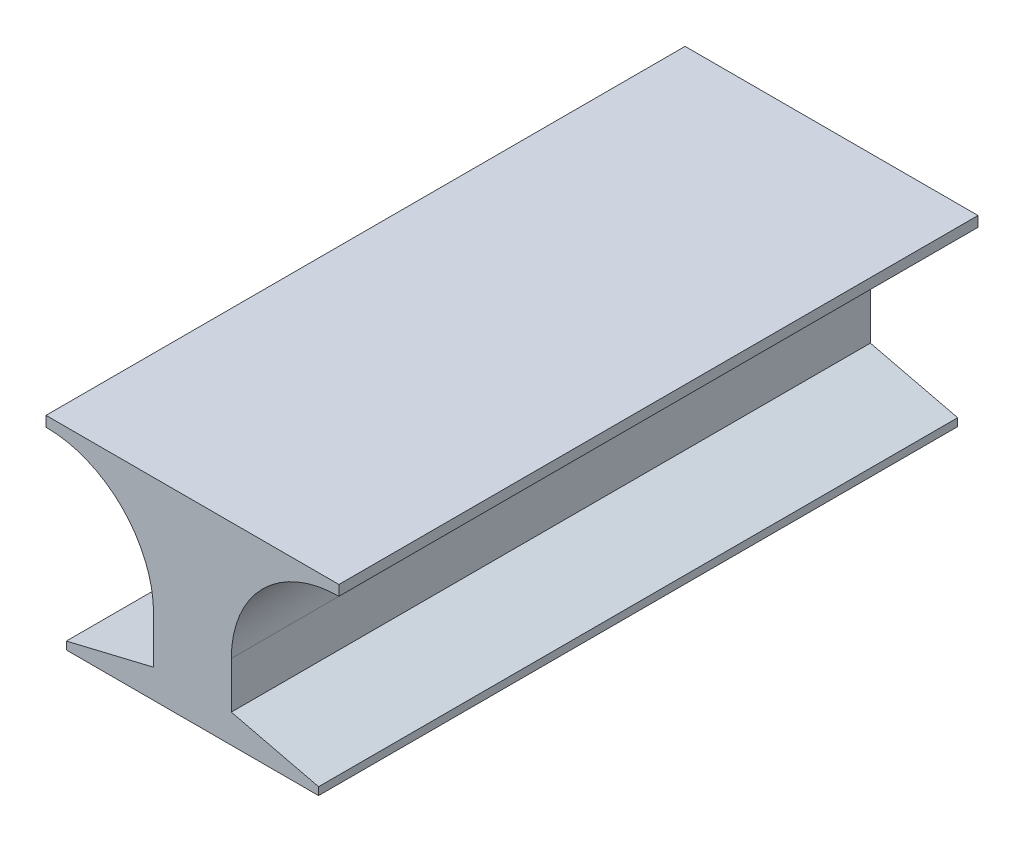
ISO-10303-21;
HEADER;
FILE_DESCRIPTION(('STEP AP214'),'2;1');
FILE_NAME('part.step','',(''),(''),'','','');
FILE_SCHEMA(('AUTOMOTIVE_DESIGN { 1 0 10303 214 1 1 1 1 }'));
ENDSEC;
DATA;
#1=APPLICATION_CONTEXT('core data for automotive mechanical design processes');
#2=APPLICATION_PROTOCOL_DEFINITION('international standard','automotive_design',2000,#1);
#3=PRODUCT_CONTEXT('',#1,'mechanical');
#4=PRODUCT('Part','Part','',(#3));
#5=PRODUCT_RELATED_PRODUCT_CATEGORY('part','',(#4));
#6=PRODUCT_DEFINITION_FORMATION('','',#4);
#7=PRODUCT_DEFINITION_CONTEXT('part definition',#1,'design');
#8=PRODUCT_DEFINITION('design','',#6,#7);
#9=PRODUCT_DEFINITION_SHAPE('','',#8);
#10=(LENGTH_UNIT() NAMED_UNIT(*) SI_UNIT(.MILLI.,.METRE.));
#11=(NAMED_UNIT(*) PLANE_ANGLE_UNIT() SI_UNIT($,.RADIAN.));
#12=(NAMED_UNIT(*) SI_UNIT($,.STERADIAN.) SOLID_ANGLE_UNIT());
#13=UNCERTAINTY_MEASURE_WITH_UNIT(LENGTH_MEASURE(1.E-05),#10,'distance_accuracy_value','');
#14=(GEOMETRIC_REPRESENTATION_CONTEXT(3) GLOBAL_UNCERTAINTY_ASSIGNED_CONTEXT((#13)) GLOBAL_UNIT_ASSIGNED_CONTEXT((#10,
#11,#12)) REPRESENTATION_CONTEXT('',''));
#15=CARTESIAN_POINT('',(0.,0.,0.));
#16=DIRECTION('',(0.,0.,1.));
#17=DIRECTION('',(1.,0.,0.));
#18=AXIS2_PLACEMENT_3D('',#15,#16,#17);
#19=CARTESIAN_POINT('',(-558.8,736.6,1219.2));
#20=DIRECTION('',(1.,0.,0.));
#21=DIRECTION('',(0.,0.,-1.));
#22=AXIS2_PLACEMENT_3D('',#19,#20,#21);
#23=PLANE('',#22);
#24=DIRECTION('',(0.,-1.,0.));
#25=VECTOR('',#24,1.);
#26=CARTESIAN_POINT('',(-558.8,736.6,-1219.2));
#27=LINE('',#26,#25);
#28=CARTESIAN_POINT('',(-558.8,736.6,-1219.2));
#29=VERTEX_POINT('',#28);
#30=CARTESIAN_POINT('',(-558.8,697.40027195096,-1219.2));
#31=VERTEX_POINT('',#30);
#32=EDGE_CURVE('E141',#29,#31,#27,.T.);
#33=ORIENTED_EDGE('',*,*,#32,.T.);
#34=DIRECTION('',(0.,0.,1.));
#35=VECTOR('',#34,1.);
#36=CARTESIAN_POINT('',(-558.8,697.40027195096,-1219.2));
#37=LINE('',#36,#35);
#38=CARTESIAN_POINT('',(-558.8,697.40027195096,1219.2));
#39=VERTEX_POINT('',#38);
#40=EDGE_CURVE('E124',#31,#39,#37,.T.);
#41=ORIENTED_EDGE('',*,*,#40,.T.);
#42=DIRECTION('',(0.,-1.,0.));
#43=VECTOR('',#42,1.);
#44=CARTESIAN_POINT('',(-558.8,736.6,1219.2));
#45=LINE('',#44,#43);
#46=CARTESIAN_POINT('',(-558.8,736.6,1219.2));
#47=VERTEX_POINT('',#46);
#48=EDGE_CURVE('E11',#47,#39,#45,.T.);
#49=ORIENTED_EDGE('',*,*,#48,.F.);
#50=DIRECTION('',(0.,0.,1.));
#51=VECTOR('',#50,1.);
#52=CARTESIAN_POINT('',(-558.8,736.6,1219.2));
#53=LINE('',#52,#51);
#54=EDGE_CURVE('E148',#29,#47,#53,.T.);
#55=ORIENTED_EDGE('',*,*,#54,.F.);
#56=EDGE_LOOP('',(#33,#41,#49,#55));
#57=FACE_BOUND('',#56,.T.);
#58=ADVANCED_FACE('F34',(#57),#23,.F.);
#59=CARTESIAN_POINT('',(558.8,736.6,1219.2));
#60=DIRECTION('',(0.,0.,-1.));
#61=DIRECTION('',(-1.,0.,0.));
#62=AXIS2_PLACEMENT_3D('',#59,#60,#61);
#63=PLANE('',#62);
#64=ORIENTED_EDGE('',*,*,#48,.T.);
#65=CARTESIAN_POINT('',(-558.8,286.887438159839,1219.2));
#66=DIRECTION('',(0.,0.,1.));
#67=DIRECTION('',(1.,0.,0.));
#68=AXIS2_PLACEMENT_3D('',#65,#66,#67);
#69=CIRCLE('',#68,410.51283379112);
#70=CARTESIAN_POINT('',(-148.287166208879,286.88743815984,1219.2));
#71=VERTEX_POINT('',#70);
#72=EDGE_CURVE('E130',#71,#39,#69,.T.);
#73=ORIENTED_EDGE('',*,*,#72,.F.);
#74=DIRECTION('',(0.,1.,0.));
#75=VECTOR('',#74,1.);
#76=CARTESIAN_POINT('',(-148.287166208879,109.524357008043,1219.2));
#77=LINE('',#76,#75);
#78=CARTESIAN_POINT('',(-148.287166208879,109.524357008043,1219.2));
#79=VERTEX_POINT('',#78);
#80=EDGE_CURVE('E145',#79,#71,#77,.T.);
#81=ORIENTED_EDGE('',*,*,#80,.F.);
#82=DIRECTION('',(0.972348746531217,0.233533541743305,0.));
#83=VECTOR('',#82,1.);
#84=CARTESIAN_POINT('',(-148.287166208879,109.524357008043,1219.2));
#85=LINE('',#84,#83);
#86=CARTESIAN_POINT('',(-481.206392305285,29.5655909150195,1219.2));
#87=VERTEX_POINT('',#86);
#88=EDGE_CURVE('E267',#87,#79,#85,.T.);
#89=ORIENTED_EDGE('',*,*,#88,.F.);
#90=DIRECTION('',(0.,1.,0.));
#91=VECTOR('',#90,1.);
#92=CARTESIAN_POINT('',(-481.206392305285,29.5655909150195,1219.2));
#93=LINE('',#92,#91);
#94=CARTESIAN_POINT('',(-481.206392305285,0.,1219.2));
#95=VERTEX_POINT('',#94);
#96=EDGE_CURVE('E265',#95,#87,#93,.T.);
#97=ORIENTED_EDGE('',*,*,#96,.F.);
#98=DIRECTION('',(1.,0.,0.));
#99=VECTOR('',#98,1.);
#100=CARTESIAN_POINT('',(558.8,0.,1219.2));
#101=LINE('',#100,#99);
#102=CARTESIAN_POINT('',(481.206392305285,0.,1219.2));
#103=VERTEX_POINT('',#102);
#104=EDGE_CURVE('E56',#95,#103,#101,.T.);
#105=ORIENTED_EDGE('',*,*,#104,.T.);
#106=DIRECTION('',(0.,-1.,0.));
#107=VECTOR('',#106,1.);
#108=CARTESIAN_POINT('',(481.206392305285,29.5655909150193,1219.2));
#109=LINE('',#108,#107);
#110=CARTESIAN_POINT('',(481.206392305285,29.5655909150193,1219.2));
#111=VERTEX_POINT('',#110);
#112=EDGE_CURVE('E189',#111,#103,#109,.T.);
#113=ORIENTED_EDGE('',*,*,#112,.F.);
#114=DIRECTION('',(0.972348746531216,-0.233533541743306,0.));
#115=VECTOR('',#114,1.);
#116=CARTESIAN_POINT('',(148.287166208879,109.524357008043,1219.2));
#117=LINE('',#116,#115);
#118=CARTESIAN_POINT('',(148.287166208879,109.524357008043,1219.2));
#119=VERTEX_POINT('',#118);
#120=EDGE_CURVE('E179',#119,#111,#117,.T.);
#121=ORIENTED_EDGE('',*,*,#120,.F.);
#122=DIRECTION('',(0.,-1.,0.));
#123=VECTOR('',#122,1.);
#124=CARTESIAN_POINT('',(148.287166208879,109.524357008043,1219.2));
#125=LINE('',#124,#123);
#126=CARTESIAN_POINT('',(148.287166208879,286.88743815984,1219.2));
#127=VERTEX_POINT('',#126);
#128=EDGE_CURVE('E175',#127,#119,#125,.T.);
#129=ORIENTED_EDGE('',*,*,#128,.F.);
#130=CARTESIAN_POINT('',(558.8,286.887438159839,1219.2));
#131=DIRECTION('',(0.,0.,1.));
#132=DIRECTION('',(-1.,0.,0.));
#133=AXIS2_PLACEMENT_3D('',#130,#131,#132);
#134=CIRCLE('',#133,410.51283379112);
#135=CARTESIAN_POINT('',(558.8,697.40027195096,1219.2));
#136=VERTEX_POINT('',#135);
#137=EDGE_CURVE('E172',#136,#127,#134,.T.);
#138=ORIENTED_EDGE('',*,*,#137,.F.);
#139=DIRECTION('',(0.,-1.,0.));
#140=VECTOR('',#139,1.);
#141=CARTESIAN_POINT('',(558.8,736.6,1219.2));
#142=LINE('',#141,#140);
#143=CARTESIAN_POINT('',(558.8,736.6,1219.2));
#144=VERTEX_POINT('',#143);
#145=EDGE_CURVE('E41',#144,#136,#142,.T.);
#146=ORIENTED_EDGE('',*,*,#145,.F.);
#147=DIRECTION('',(1.,0.,0.));
#148=VECTOR('',#147,1.);
#149=CARTESIAN_POINT('',(558.8,736.6,1219.2));
#150=LINE('',#149,#148);
#151=EDGE_CURVE('E169',#47,#144,#150,.T.);
#152=ORIENTED_EDGE('',*,*,#151,.F.);
#153=EDGE_LOOP('',(#64,#73,#81,#89,#97,#105,#113,#121,#129,#138,#146,#152));
#154=FACE_BOUND('',#153,.T.);
#155=ADVANCED_FACE('F168',(#154),#63,.F.);
#156=CARTESIAN_POINT('',(558.8,736.6,1219.2));
#157=DIRECTION('',(-1.,0.,0.));
#158=DIRECTION('',(0.,0.,1.));
#159=AXIS2_PLACEMENT_3D('',#156,#157,#158);
#160=PLANE('',#159);
#161=ORIENTED_EDGE('',*,*,#145,.T.);
#162=DIRECTION('',(0.,0.,1.));
#163=VECTOR('',#162,1.);
#164=CARTESIAN_POINT('',(558.8,697.40027195096,-1219.2));
#165=LINE('',#164,#163);
#166=CARTESIAN_POINT('',(558.8,697.40027195096,-1219.2));
#167=VERTEX_POINT('',#166);
#168=EDGE_CURVE('E166',#167,#136,#165,.T.);
#169=ORIENTED_EDGE('',*,*,#168,.F.);
#170=DIRECTION('',(0.,-1.,0.));
#171=VECTOR('',#170,1.);
#172=CARTESIAN_POINT('',(558.8,736.6,-1219.2));
#173=LINE('',#172,#171);
#174=CARTESIAN_POINT('',(558.8,736.6,-1219.2));
#175=VERTEX_POINT('',#174);
#176=EDGE_CURVE('E149',#175,#167,#173,.T.);
#177=ORIENTED_EDGE('',*,*,#176,.F.);
#178=DIRECTION('',(0.,0.,-1.));
#179=VECTOR('',#178,1.);
#180=CARTESIAN_POINT('',(558.8,736.6,1219.2));
#181=LINE('',#180,#179);
#182=EDGE_CURVE('E154',#144,#175,#181,.T.);
#183=ORIENTED_EDGE('',*,*,#182,.F.);
#184=EDGE_LOOP('',(#161,#169,#177,#183));
#185=FACE_BOUND('',#184,.T.);
#186=ADVANCED_FACE('F164',(#185),#160,.F.);
#187=CARTESIAN_POINT('',(558.8,736.6,-1219.2));
#188=DIRECTION('',(0.,0.,1.));
#189=DIRECTION('',(1.,0.,0.));
#190=AXIS2_PLACEMENT_3D('',#187,#188,#189);
#191=PLANE('',#190);
#192=DIRECTION('',(0.,1.,0.));
#193=VECTOR('',#192,1.);
#194=CARTESIAN_POINT('',(-148.287166208879,109.524357008043,-1219.2));
#195=LINE('',#194,#193);
#196=CARTESIAN_POINT('',(-148.287166208879,109.524357008043,-1219.2));
#197=VERTEX_POINT('',#196);
#198=CARTESIAN_POINT('',(-148.287166208879,286.88743815984,-1219.2));
#199=VERTEX_POINT('',#198);
#200=EDGE_CURVE('E135',#197,#199,#195,.T.);
#201=ORIENTED_EDGE('',*,*,#200,.T.);
#202=CARTESIAN_POINT('',(-558.8,286.887438159839,-1219.2));
#203=DIRECTION('',(0.,0.,1.));
#204=DIRECTION('',(1.,0.,0.));
#205=AXIS2_PLACEMENT_3D('',#202,#203,#204);
#206=CIRCLE('',#205,410.51283379112);
#207=EDGE_CURVE('E127',#199,#31,#206,.T.);
#208=ORIENTED_EDGE('',*,*,#207,.T.);
#209=ORIENTED_EDGE('',*,*,#32,.F.);
#210=DIRECTION('',(-1.,0.,0.));
#211=VECTOR('',#210,1.);
#212=CARTESIAN_POINT('',(558.8,736.6,-1219.2));
#213=LINE('',#212,#211);
#214=EDGE_CURVE('E150',#175,#29,#213,.T.);
#215=ORIENTED_EDGE('',*,*,#214,.F.);
#216=ORIENTED_EDGE('',*,*,#176,.T.);
#217=CARTESIAN_POINT('',(558.8,286.887438159839,-1219.2));
#218=DIRECTION('',(0.,0.,1.));
#219=DIRECTION('',(-1.,0.,0.));
#220=AXIS2_PLACEMENT_3D('',#217,#218,#219);
#221=CIRCLE('',#220,410.51283379112);
#222=CARTESIAN_POINT('',(148.287166208879,286.88743815984,-1219.2));
#223=VERTEX_POINT('',#222);
#224=EDGE_CURVE('E191',#167,#223,#221,.T.);
#225=ORIENTED_EDGE('',*,*,#224,.T.);
#226=DIRECTION('',(0.,-1.,0.));
#227=VECTOR('',#226,1.);
#228=CARTESIAN_POINT('',(148.287166208879,109.524357008043,-1219.2));
#229=LINE('',#228,#227);
#230=CARTESIAN_POINT('',(148.287166208879,109.524357008043,-1219.2));
#231=VERTEX_POINT('',#230);
#232=EDGE_CURVE('E219',#223,#231,#229,.T.);
#233=ORIENTED_EDGE('',*,*,#232,.T.);
#234=DIRECTION('',(0.972348746531216,-0.233533541743306,0.));
#235=VECTOR('',#234,1.);
#236=CARTESIAN_POINT('',(148.287166208879,109.524357008043,-1219.2));
#237=LINE('',#236,#235);
#238=CARTESIAN_POINT('',(481.206392305285,29.5655909150193,-1219.2));
#239=VERTEX_POINT('',#238);
#240=EDGE_CURVE('E221',#231,#239,#237,.T.);
#241=ORIENTED_EDGE('',*,*,#240,.T.);
#242=DIRECTION('',(0.,-1.,0.));
#243=VECTOR('',#242,1.);
#244=CARTESIAN_POINT('',(481.206392305285,29.5655909150193,-1219.2));
#245=LINE('',#244,#243);
#246=CARTESIAN_POINT('',(481.206392305285,-2.22044604925031E-13,-1219.2));
#247=VERTEX_POINT('',#246);
#248=EDGE_CURVE('E184',#239,#247,#245,.T.);
#249=ORIENTED_EDGE('',*,*,#248,.T.);
#250=DIRECTION('',(-1.,0.,0.));
#251=VECTOR('',#250,1.);
#252=CARTESIAN_POINT('',(558.8,0.,-1219.2));
#253=LINE('',#252,#251);
#254=CARTESIAN_POINT('',(-481.206392305285,0.,-1219.2));
#255=VERTEX_POINT('',#254);
#256=EDGE_CURVE('E157',#247,#255,#253,.T.);
#257=ORIENTED_EDGE('',*,*,#256,.T.);
#258=DIRECTION('',(0.,1.,0.));
#259=VECTOR('',#258,1.);
#260=CARTESIAN_POINT('',(-481.206392305285,29.5655909150195,-1219.2));
#261=LINE('',#260,#259);
#262=CARTESIAN_POINT('',(-481.206392305285,29.5655909150195,-1219.2));
#263=VERTEX_POINT('',#262);
#264=EDGE_CURVE('E48',#255,#263,#261,.T.);
#265=ORIENTED_EDGE('',*,*,#264,.T.);
#266=DIRECTION('',(0.972348746531217,0.233533541743305,0.));
#267=VECTOR('',#266,1.);
#268=CARTESIAN_POINT('',(-148.287166208879,109.524357008043,-1219.2));
#269=LINE('',#268,#267);
#270=EDGE_CURVE('E280',#263,#197,#269,.T.);
#271=ORIENTED_EDGE('',*,*,#270,.T.);
#272=EDGE_LOOP('',(#201,#208,#209,#215,#216,#225,#233,#241,#249,#257,#265,#271));
#273=FACE_BOUND('',#272,.T.);
#274=ADVANCED_FACE('F139',(#273),#191,.F.);
#275=CARTESIAN_POINT('',(0.,736.6,0.));
#276=DIRECTION('',(0.,1.,0.));
#277=DIRECTION('',(0.,0.,1.));
#278=AXIS2_PLACEMENT_3D('',#275,#276,#277);
#279=PLANE('',#278);
#280=ORIENTED_EDGE('',*,*,#54,.T.);
#281=ORIENTED_EDGE('',*,*,#151,.T.);
#282=ORIENTED_EDGE('',*,*,#182,.T.);
#283=ORIENTED_EDGE('',*,*,#214,.T.);
#284=EDGE_LOOP('',(#280,#281,#282,#283));
#285=FACE_BOUND('',#284,.T.);
#286=ADVANCED_FACE('F237',(#285),#279,.T.);
#287=CARTESIAN_POINT('',(0.,0.,0.));
#288=DIRECTION('',(0.,1.,0.));
#289=DIRECTION('',(0.,0.,1.));
#290=AXIS2_PLACEMENT_3D('',#287,#288,#289);
#291=PLANE('',#290);
#292=ORIENTED_EDGE('',*,*,#104,.F.);
#293=DIRECTION('',(0.,0.,1.));
#294=VECTOR('',#293,1.);
#295=CARTESIAN_POINT('',(-481.206392305285,0.,-1219.2));
#296=LINE('',#295,#294);
#297=EDGE_CURVE('E134',#255,#95,#296,.T.);
#298=ORIENTED_EDGE('',*,*,#297,.F.);
#299=ORIENTED_EDGE('',*,*,#256,.F.);
#300=DIRECTION('',(0.,0.,1.));
#301=VECTOR('',#300,1.);
#302=CARTESIAN_POINT('',(481.206392305285,-2.22044604925031E-13,-1219.2));
#303=LINE('',#302,#301);
#304=EDGE_CURVE('E192',#247,#103,#303,.T.);
#305=ORIENTED_EDGE('',*,*,#304,.T.);
#306=EDGE_LOOP('',(#292,#298,#299,#305));
#307=FACE_BOUND('',#306,.T.);
#308=ADVANCED_FACE('F210',(#307),#291,.F.);
#309=CARTESIAN_POINT('',(481.206392305285,29.5655909150193,-1219.2));
#310=DIRECTION('',(-1.,0.,0.));
#311=DIRECTION('',(0.,0.,1.));
#312=AXIS2_PLACEMENT_3D('',#309,#310,#311);
#313=PLANE('',#312);
#314=ORIENTED_EDGE('',*,*,#112,.T.);
#315=ORIENTED_EDGE('',*,*,#304,.F.);
#316=ORIENTED_EDGE('',*,*,#248,.F.);
#317=DIRECTION('',(0.,0.,1.));
#318=VECTOR('',#317,1.);
#319=CARTESIAN_POINT('',(481.206392305285,29.5655909150193,-1219.2));
#320=LINE('',#319,#318);
#321=EDGE_CURVE('E195',#239,#111,#320,.T.);
#322=ORIENTED_EDGE('',*,*,#321,.T.);
#323=EDGE_LOOP('',(#314,#315,#316,#322));
#324=FACE_BOUND('',#323,.T.);
#325=ADVANCED_FACE('F227',(#324),#313,.F.);
#326=CARTESIAN_POINT('',(148.287166208879,109.524357008043,-1219.2));
#327=DIRECTION('',(-0.233533541743306,-0.972348746531216,0.));
#328=DIRECTION('',(0.972348746531217,-0.233533541743306,0.));
#329=AXIS2_PLACEMENT_3D('',#326,#327,#328);
#330=PLANE('',#329);
#331=ORIENTED_EDGE('',*,*,#120,.T.);
#332=ORIENTED_EDGE('',*,*,#321,.F.);
#333=ORIENTED_EDGE('',*,*,#240,.F.);
#334=DIRECTION('',(0.,0.,1.));
#335=VECTOR('',#334,1.);
#336=CARTESIAN_POINT('',(148.287166208879,109.524357008043,-1219.2));
#337=LINE('',#336,#335);
#338=EDGE_CURVE('E197',#231,#119,#337,.T.);
#339=ORIENTED_EDGE('',*,*,#338,.T.);
#340=EDGE_LOOP('',(#331,#332,#333,#339));
#341=FACE_BOUND('',#340,.T.);
#342=ADVANCED_FACE('F225',(#341),#330,.F.);
#343=CARTESIAN_POINT('',(148.287166208879,109.524357008043,-1219.2));
#344=DIRECTION('',(-1.,0.,0.));
#345=DIRECTION('',(0.,-1.,0.));
#346=AXIS2_PLACEMENT_3D('',#343,#344,#345);
#347=PLANE('',#346);
#348=ORIENTED_EDGE('',*,*,#128,.T.);
#349=ORIENTED_EDGE('',*,*,#338,.F.);
#350=ORIENTED_EDGE('',*,*,#232,.F.);
#351=DIRECTION('',(0.,0.,1.));
#352=VECTOR('',#351,1.);
#353=CARTESIAN_POINT('',(148.287166208879,286.88743815984,-1219.2));
#354=LINE('',#353,#352);
#355=EDGE_CURVE('E199',#223,#127,#354,.T.);
#356=ORIENTED_EDGE('',*,*,#355,.T.);
#357=EDGE_LOOP('',(#348,#349,#350,#356));
#358=FACE_BOUND('',#357,.T.);
#359=ADVANCED_FACE('F234',(#358),#347,.F.);
#360=CARTESIAN_POINT('',(558.8,286.887438159839,-1219.2));
#361=DIRECTION('',(0.,0.,1.));
#362=DIRECTION('',(1.,0.,0.));
#363=AXIS2_PLACEMENT_3D('',#360,#361,#362);
#364=CYLINDRICAL_SURFACE('',#363,410.51283379112);
#365=ORIENTED_EDGE('',*,*,#137,.T.);
#366=ORIENTED_EDGE('',*,*,#355,.F.);
#367=ORIENTED_EDGE('',*,*,#224,.F.);
#368=ORIENTED_EDGE('',*,*,#168,.T.);
#369=EDGE_LOOP('',(#365,#366,#367,#368));
#370=FACE_BOUND('',#369,.T.);
#371=ADVANCED_FACE('F255',(#370),#364,.F.);
#372=CARTESIAN_POINT('',(-558.8,286.887438159839,-1219.2));
#373=DIRECTION('',(0.,0.,1.));
#374=DIRECTION('',(1.,0.,0.));
#375=AXIS2_PLACEMENT_3D('',#372,#373,#374);
#376=CYLINDRICAL_SURFACE('',#375,410.51283379112);
#377=ORIENTED_EDGE('',*,*,#72,.T.);
#378=ORIENTED_EDGE('',*,*,#40,.F.);
#379=ORIENTED_EDGE('',*,*,#207,.F.);
#380=DIRECTION('',(0.,0.,1.));
#381=VECTOR('',#380,1.);
#382=CARTESIAN_POINT('',(-148.287166208879,286.88743815984,-1219.2));
#383=LINE('',#382,#381);
#384=EDGE_CURVE('E177',#199,#71,#383,.T.);
#385=ORIENTED_EDGE('',*,*,#384,.T.);
#386=EDGE_LOOP('',(#377,#378,#379,#385));
#387=FACE_BOUND('',#386,.T.);
#388=ADVANCED_FACE('F126',(#387),#376,.F.);
#389=CARTESIAN_POINT('',(-148.287166208879,109.524357008043,-1219.2));
#390=DIRECTION('',(1.,0.,0.));
#391=DIRECTION('',(0.,1.,0.));
#392=AXIS2_PLACEMENT_3D('',#389,#390,#391);
#393=PLANE('',#392);
#394=ORIENTED_EDGE('',*,*,#80,.T.);
#395=ORIENTED_EDGE('',*,*,#384,.F.);
#396=ORIENTED_EDGE('',*,*,#200,.F.);
#397=DIRECTION('',(0.,0.,1.));
#398=VECTOR('',#397,1.);
#399=CARTESIAN_POINT('',(-148.287166208879,109.524357008043,-1219.2));
#400=LINE('',#399,#398);
#401=EDGE_CURVE('E181',#197,#79,#400,.T.);
#402=ORIENTED_EDGE('',*,*,#401,.T.);
#403=EDGE_LOOP('',(#394,#395,#396,#402));
#404=FACE_BOUND('',#403,.T.);
#405=ADVANCED_FACE('F275',(#404),#393,.F.);
#406=CARTESIAN_POINT('',(-148.287166208879,109.524357008043,-1219.2));
#407=DIRECTION('',(0.233533541743305,-0.972348746531217,0.));
#408=DIRECTION('',(0.972348746531217,0.233533541743305,0.));
#409=AXIS2_PLACEMENT_3D('',#406,#407,#408);
#410=PLANE('',#409);
#411=ORIENTED_EDGE('',*,*,#88,.T.);
#412=ORIENTED_EDGE('',*,*,#401,.F.);
#413=ORIENTED_EDGE('',*,*,#270,.F.);
#414=DIRECTION('',(0.,0.,1.));
#415=VECTOR('',#414,1.);
#416=CARTESIAN_POINT('',(-481.206392305285,29.5655909150195,-1219.2));
#417=LINE('',#416,#415);
#418=EDGE_CURVE('E212',#263,#87,#417,.T.);
#419=ORIENTED_EDGE('',*,*,#418,.T.);
#420=EDGE_LOOP('',(#411,#412,#413,#419));
#421=FACE_BOUND('',#420,.T.);
#422=ADVANCED_FACE('F278',(#421),#410,.F.);
#423=CARTESIAN_POINT('',(-481.206392305285,29.5655909150195,-1219.2));
#424=DIRECTION('',(1.,0.,0.));
#425=DIRECTION('',(0.,0.,-1.));
#426=AXIS2_PLACEMENT_3D('',#423,#424,#425);
#427=PLANE('',#426);
#428=ORIENTED_EDGE('',*,*,#96,.T.);
#429=ORIENTED_EDGE('',*,*,#418,.F.);
#430=ORIENTED_EDGE('',*,*,#264,.F.);
#431=ORIENTED_EDGE('',*,*,#297,.T.);
#432=EDGE_LOOP('',(#428,#429,#430,#431));
#433=FACE_BOUND('',#432,.T.);
#434=ADVANCED_FACE('F279',(#433),#427,.F.);
#435=CLOSED_SHELL('',(#58,#155,#186,#274,#286,#308,#325,#342,#359,#371,#388,#405,#422,#434));
#436=MANIFOLD_SOLID_BREP('B2',#435);
#437=ADVANCED_BREP_SHAPE_REPRESENTATION('',(#18,#436),#14);
#438=SHAPE_DEFINITION_REPRESENTATION(#9,#437);
ENDSEC;
END-ISO-10303-21;
